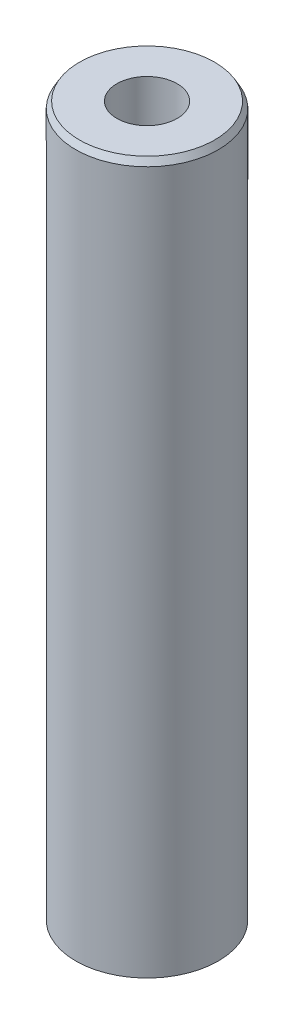
ISO-10303-21;
HEADER;
FILE_DESCRIPTION(('STEP AP214'),'2;1');
FILE_NAME('part.step','',(''),(''),'','','');
FILE_SCHEMA(('AUTOMOTIVE_DESIGN { 1 0 10303 214 1 1 1 1 }'));
ENDSEC;
DATA;
#1=APPLICATION_CONTEXT('core data for automotive mechanical design processes');
#2=APPLICATION_PROTOCOL_DEFINITION('international standard','automotive_design',2000,#1);
#3=PRODUCT_CONTEXT('',#1,'mechanical');
#4=PRODUCT('Part','Part','',(#3));
#5=PRODUCT_RELATED_PRODUCT_CATEGORY('part','',(#4));
#6=PRODUCT_DEFINITION_FORMATION('','',#4);
#7=PRODUCT_DEFINITION_CONTEXT('part definition',#1,'design');
#8=PRODUCT_DEFINITION('design','',#6,#7);
#9=PRODUCT_DEFINITION_SHAPE('','',#8);
#10=(LENGTH_UNIT() NAMED_UNIT(*) SI_UNIT(.MILLI.,.METRE.));
#11=(NAMED_UNIT(*) PLANE_ANGLE_UNIT() SI_UNIT($,.RADIAN.));
#12=(NAMED_UNIT(*) SI_UNIT($,.STERADIAN.) SOLID_ANGLE_UNIT());
#13=UNCERTAINTY_MEASURE_WITH_UNIT(LENGTH_MEASURE(1.E-05),#10,'distance_accuracy_value','');
#14=(GEOMETRIC_REPRESENTATION_CONTEXT(3) GLOBAL_UNCERTAINTY_ASSIGNED_CONTEXT((#13)) GLOBAL_UNIT_ASSIGNED_CONTEXT((#10,
#11,#12)) REPRESENTATION_CONTEXT('',''));
#15=CARTESIAN_POINT('',(0.,0.,0.));
#16=DIRECTION('',(0.,0.,1.));
#17=DIRECTION('',(1.,0.,0.));
#18=AXIS2_PLACEMENT_3D('',#15,#16,#17);
#19=CARTESIAN_POINT('',(0.,600.,0.));
#20=DIRECTION('',(0.,-1.,0.));
#21=DIRECTION('',(0.,0.,-1.));
#22=AXIS2_PLACEMENT_3D('',#19,#20,#21);
#23=CYLINDRICAL_SURFACE('',#22,60.);
#24=CARTESIAN_POINT('',(0.,594.518208074805,0.));
#25=DIRECTION('',(0.,1.,0.));
#26=DIRECTION('',(0.,0.,1.));
#27=AXIS2_PLACEMENT_3D('',#24,#25,#26);
#28=CIRCLE('',#27,60.);
#29=CARTESIAN_POINT('',(0.,594.518208074805,-60.));
#30=VERTEX_POINT('',#29);
#31=EDGE_CURVE('E50',#30,#30,#28,.F.);
#32=ORIENTED_EDGE('',*,*,#31,.T.);
#33=EDGE_LOOP('',(#32));
#34=FACE_BOUND('',#33,.T.);
#35=CARTESIAN_POINT('',(0.,3.16491404365316,0.));
#36=DIRECTION('',(0.,1.,0.));
#37=DIRECTION('',(0.,0.,1.));
#38=AXIS2_PLACEMENT_3D('',#35,#36,#37);
#39=CIRCLE('',#38,60.);
#40=CARTESIAN_POINT('',(0.,3.16491404365316,60.));
#41=VERTEX_POINT('',#40);
#42=EDGE_CURVE('E51',#41,#41,#39,.T.);
#43=ORIENTED_EDGE('',*,*,#42,.T.);
#44=EDGE_LOOP('',(#43));
#45=FACE_BOUND('',#44,.T.);
#46=ADVANCED_FACE('F39',(#34,#45),#23,.T.);
#47=CARTESIAN_POINT('',(0.,600.,0.));
#48=DIRECTION('',(0.,1.,0.));
#49=DIRECTION('',(0.,0.,1.));
#50=AXIS2_PLACEMENT_3D('',#47,#48,#49);
#51=PLANE('',#50);
#52=CARTESIAN_POINT('',(0.,600.,0.));
#53=DIRECTION('',(0.,1.,0.));
#54=DIRECTION('',(0.,0.,1.));
#55=AXIS2_PLACEMENT_3D('',#52,#53,#54);
#56=CIRCLE('',#55,56.8350859563469);
#57=CARTESIAN_POINT('',(0.,600.,-56.8350859563469));
#58=VERTEX_POINT('',#57);
#59=EDGE_CURVE('E54',#58,#58,#56,.T.);
#60=ORIENTED_EDGE('',*,*,#59,.T.);
#61=EDGE_LOOP('',(#60));
#62=FACE_BOUND('',#61,.T.);
#63=CARTESIAN_POINT('',(0.,600.,0.));
#64=DIRECTION('',(0.,1.,0.));
#65=DIRECTION('',(0.,0.,1.));
#66=AXIS2_PLACEMENT_3D('',#63,#64,#65);
#67=CIRCLE('',#66,25.380839497585);
#68=CARTESIAN_POINT('',(0.,600.,25.380839497585));
#69=VERTEX_POINT('',#68);
#70=EDGE_CURVE('E58',#69,#69,#67,.T.);
#71=ORIENTED_EDGE('',*,*,#70,.F.);
#72=EDGE_LOOP('',(#71));
#73=FACE_BOUND('',#72,.T.);
#74=ADVANCED_FACE('F69',(#62,#73),#51,.T.);
#75=CARTESIAN_POINT('',(0.,0.,0.));
#76=DIRECTION('',(0.,1.,0.));
#77=DIRECTION('',(0.,0.,1.));
#78=AXIS2_PLACEMENT_3D('',#75,#76,#77);
#79=PLANE('',#78);
#80=CARTESIAN_POINT('',(0.,0.,0.));
#81=DIRECTION('',(0.,1.,0.));
#82=DIRECTION('',(0.,0.,1.));
#83=AXIS2_PLACEMENT_3D('',#80,#81,#82);
#84=CIRCLE('',#83,54.5182080748044);
#85=CARTESIAN_POINT('',(0.,0.,54.5182080748044));
#86=VERTEX_POINT('',#85);
#87=EDGE_CURVE('E10',#86,#86,#84,.F.);
#88=ORIENTED_EDGE('',*,*,#87,.T.);
#89=EDGE_LOOP('',(#88));
#90=FACE_BOUND('',#89,.T.);
#91=CARTESIAN_POINT('',(0.,0.,0.));
#92=DIRECTION('',(0.,1.,0.));
#93=DIRECTION('',(0.,0.,1.));
#94=AXIS2_PLACEMENT_3D('',#91,#92,#93);
#95=CIRCLE('',#94,25.380839497585);
#96=CARTESIAN_POINT('',(0.,0.,25.380839497585));
#97=VERTEX_POINT('',#96);
#98=EDGE_CURVE('E63',#97,#97,#95,.T.);
#99=ORIENTED_EDGE('',*,*,#98,.T.);
#100=EDGE_LOOP('',(#99));
#101=FACE_BOUND('',#100,.T.);
#102=ADVANCED_FACE('F75',(#90,#101),#79,.F.);
#103=CARTESIAN_POINT('',(0.,600.,0.));
#104=DIRECTION('',(0.,-1.,0.));
#105=DIRECTION('',(0.,0.,-1.));
#106=AXIS2_PLACEMENT_3D('',#103,#104,#105);
#107=CYLINDRICAL_SURFACE('',#106,25.380839497585);
#108=ORIENTED_EDGE('',*,*,#70,.T.);
#109=EDGE_LOOP('',(#108));
#110=FACE_BOUND('',#109,.T.);
#111=ORIENTED_EDGE('',*,*,#98,.F.);
#112=EDGE_LOOP('',(#111));
#113=FACE_BOUND('',#112,.T.);
#114=ADVANCED_FACE('F70',(#110,#113),#107,.F.);
#115=CARTESIAN_POINT('',(0.,600.,0.));
#116=DIRECTION('',(0.,-1.,0.));
#117=DIRECTION('',(0.,0.,-1.));
#118=AXIS2_PLACEMENT_3D('',#115,#116,#117);
#119=CONICAL_SURFACE('',#118,56.8350859563469,0.523598775598294);
#120=CARTESIAN_POINT('',(0.,594.518208074805,-60.));
#121=CARTESIAN_POINT('',(0.,594.575310074025,-59.9670321453786));
#122=CARTESIAN_POINT('',(0.,594.632412073246,-59.9340642907573));
#123=CARTESIAN_POINT('',(0.,594.746616071688,-59.8681285815145));
#124=CARTESIAN_POINT('',(0.,594.803718070908,-59.8351607268931));
#125=CARTESIAN_POINT('',(0.,594.91792206935,-59.7692250176503));
#126=CARTESIAN_POINT('',(0.,594.975024068571,-59.7362571630289));
#127=CARTESIAN_POINT('',(0.,595.089228067012,-59.6703214537862));
#128=CARTESIAN_POINT('',(0.,595.146330066233,-59.6373535991648));
#129=CARTESIAN_POINT('',(0.,595.260534064675,-59.571417889922));
#130=CARTESIAN_POINT('',(0.,595.317636063895,-59.5384500353006));
#131=CARTESIAN_POINT('',(0.,595.431840062337,-59.4725143260578));
#132=CARTESIAN_POINT('',(0.,595.488942061558,-59.4395464714365));
#133=CARTESIAN_POINT('',(0.,595.603146059999,-59.3736107621937));
#134=CARTESIAN_POINT('',(0.,595.66024805922,-59.3406429075723));
#135=CARTESIAN_POINT('',(0.,595.774452057662,-59.2747071983295));
#136=CARTESIAN_POINT('',(0.,595.831554056883,-59.2417393437081));
#137=CARTESIAN_POINT('',(0.,595.945758055324,-59.1758036344654));
#138=CARTESIAN_POINT('',(0.,596.002860054545,-59.142835779844));
#139=CARTESIAN_POINT('',(0.,596.117064052987,-59.0769000706012));
#140=CARTESIAN_POINT('',(0.,596.174166052207,-59.0439322159798));
#141=CARTESIAN_POINT('',(0.,596.288370050649,-58.977996506737));
#142=CARTESIAN_POINT('',(0.,596.345472049869,-58.9450286521157));
#143=CARTESIAN_POINT('',(0.,596.459676048311,-58.8790929428729));
#144=CARTESIAN_POINT('',(0.,596.516778047532,-58.8461250882515));
#145=CARTESIAN_POINT('',(0.,596.630982045973,-58.7801893790087));
#146=CARTESIAN_POINT('',(0.,596.688084045194,-58.7472215243873));
#147=CARTESIAN_POINT('',(0.,596.802288043636,-58.6812858151446));
#148=CARTESIAN_POINT('',(0.,596.859390042857,-58.6483179605232));
#149=CARTESIAN_POINT('',(0.,596.973594041298,-58.5823822512804));
#150=CARTESIAN_POINT('',(0.,597.030696040519,-58.549414396659));
#151=CARTESIAN_POINT('',(0.,597.144900038961,-58.4834786874162));
#152=CARTESIAN_POINT('',(0.,597.202002038181,-58.4505108327949));
#153=CARTESIAN_POINT('',(0.,597.316206036623,-58.3845751235521));
#154=CARTESIAN_POINT('',(0.,597.373308035844,-58.3516072689307));
#155=CARTESIAN_POINT('',(0.,597.487512034285,-58.2856715596879));
#156=CARTESIAN_POINT('',(0.,597.544614033506,-58.2527037050666));
#157=CARTESIAN_POINT('',(0.,597.658818031948,-58.1867679958238));
#158=CARTESIAN_POINT('',(0.,597.715920031168,-58.1538001412024));
#159=CARTESIAN_POINT('',(0.,597.83012402961,-58.0878644319596));
#160=CARTESIAN_POINT('',(0.,597.887226028831,-58.0548965773382));
#161=CARTESIAN_POINT('',(0.,598.001430027272,-57.9889608680955));
#162=CARTESIAN_POINT('',(0.,598.058532026493,-57.9559930134741));
#163=CARTESIAN_POINT('',(0.,598.172736024935,-57.8900573042313));
#164=CARTESIAN_POINT('',(0.,598.229838024155,-57.8570894496099));
#165=CARTESIAN_POINT('',(0.,598.344042022597,-57.7911537403671));
#166=CARTESIAN_POINT('',(0.,598.401144021818,-57.7581858857458));
#167=CARTESIAN_POINT('',(0.,598.515348020259,-57.692250176503));
#168=CARTESIAN_POINT('',(0.,598.57245001948,-57.6592823218816));
#169=CARTESIAN_POINT('',(0.,598.686654017922,-57.5933466126388));
#170=CARTESIAN_POINT('',(0.,598.743756017143,-57.5603787580174));
#171=CARTESIAN_POINT('',(0.,598.857960015584,-57.4944430487747));
#172=CARTESIAN_POINT('',(0.,598.915062014805,-57.4614751941533));
#173=CARTESIAN_POINT('',(0.,599.029266013247,-57.3955394849105));
#174=CARTESIAN_POINT('',(0.,599.086368012467,-57.3625716302891));
#175=CARTESIAN_POINT('',(0.,599.200572010909,-57.2966359210463));
#176=CARTESIAN_POINT('',(0.,599.25767401013,-57.263668066425));
#177=CARTESIAN_POINT('',(0.,599.371878008571,-57.1977323571822));
#178=CARTESIAN_POINT('',(0.,599.428980007792,-57.1647645025608));
#179=CARTESIAN_POINT('',(0.,599.543184006234,-57.098828793318));
#180=CARTESIAN_POINT('',(0.,599.600286005454,-57.0658609386966));
#181=CARTESIAN_POINT('',(0.,599.714490003896,-56.9999252294539));
#182=CARTESIAN_POINT('',(0.,599.771592003117,-56.9669573748325));
#183=CARTESIAN_POINT('',(0.,599.885796001558,-56.9010216655897));
#184=CARTESIAN_POINT('',(0.,599.942898000779,-56.8680538109683));
#185=CARTESIAN_POINT('',(0.,600.,-56.8350859563469));
#186=B_SPLINE_CURVE_WITH_KNOTS('',3,(#120,#121,#122,#123,#124,#125,#126,#127,#128,#129,#130,
#131,#132,#133,#134,#135,#136,#137,#138,#139,#140,#141,#142,#143,#144,#145,#146,#147,#148,#149,
#150,#151,#152,#153,#154,#155,#156,#157,#158,#159,#160,#161,#162,#163,#164,#165,#166,#167,#168,
#169,#170,#171,#172,#173,#174,#175,#176,#177,#178,#179,#180,#181,#182,#183,#184,#185),
.UNSPECIFIED.,.F.,.F.,(4,2,2,2,2,2,2,2,2,2,2,2,2,2,2,2,2,2,2,2,2,2,2,2,2,2,2,2,2,2,2,2,4),(0.,
0.197807127728315,0.39561425545663,0.593421383184945,0.791228510913257,0.989035638641572,
1.18684276636989,1.3846498940982,1.58245702182651,1.78026414955483,1.97807127728314,
2.17587840501146,2.37368553273977,2.57149266046809,2.7692997881964,2.96710691592472,
3.16491404365312,3.36272117138144,3.56052829910975,3.75833542683807,3.95614255456638,
4.1539496822947,4.35175681002301,4.54956393775133,4.74737106547964,4.94517819320795,
5.14298532093627,5.34079244866459,5.5385995763929,5.73640670412121,5.93421383184953,
6.13202095957784,6.32982808730625),.UNSPECIFIED.);
#187=EDGE_CURVE('BSEAM81',#30,#58,#186,.T.);
#188=ORIENTED_EDGE('',*,*,#31,.F.);
#189=ORIENTED_EDGE('',*,*,#59,.F.);
#190=ORIENTED_EDGE('',*,*,#187,.T.);
#191=ORIENTED_EDGE('',*,*,#187,.F.);
#192=EDGE_LOOP('',(#188,#190,#189,#191));
#193=FACE_BOUND('',#192,.T.);
#194=ADVANCED_FACE('F81',(#193),#119,.T.);
#195=CARTESIAN_POINT('',(0.,3.16491404365316,0.));
#196=DIRECTION('',(0.,1.,0.));
#197=DIRECTION('',(0.,0.,1.));
#198=AXIS2_PLACEMENT_3D('',#195,#196,#197);
#199=CONICAL_SURFACE('',#198,60.,1.0471975511966);
#200=ORIENTED_EDGE('',*,*,#87,.F.);
#201=EDGE_LOOP('',(#200));
#202=FACE_BOUND('',#201,.T.);
#203=ORIENTED_EDGE('',*,*,#42,.F.);
#204=EDGE_LOOP('',(#203));
#205=FACE_BOUND('',#204,.T.);
#206=ADVANCED_FACE('F45',(#202,#205),#199,.T.);
#207=CLOSED_SHELL('',(#46,#74,#102,#114,#194,#206));
#208=MANIFOLD_SOLID_BREP('B2',#207);
#209=ADVANCED_BREP_SHAPE_REPRESENTATION('',(#18,#208),#14);
#210=SHAPE_DEFINITION_REPRESENTATION(#9,#209);
ENDSEC;
END-ISO-10303-21;
